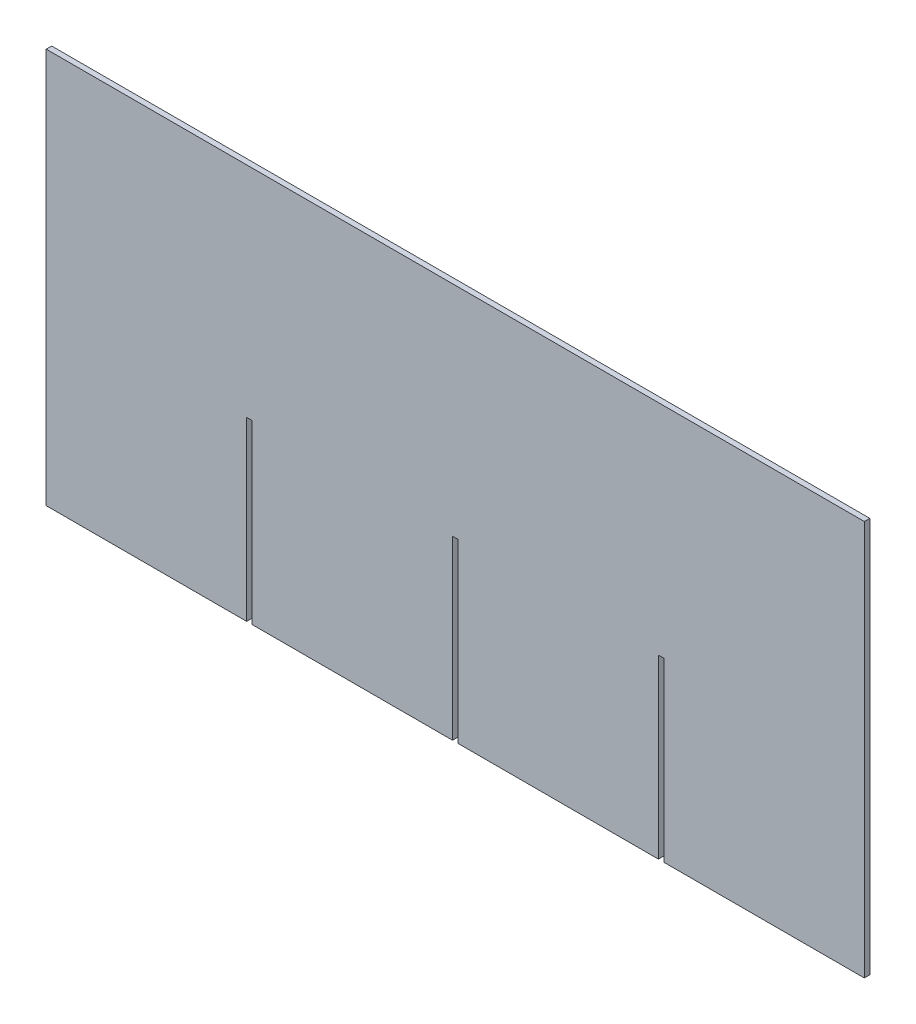
ISO-10303-21;
HEADER;
FILE_DESCRIPTION(('STEP AP214'),'2;1');
FILE_NAME('part.step','',(''),(''),'','','');
FILE_SCHEMA(('AUTOMOTIVE_DESIGN { 1 0 10303 214 1 1 1 1 }'));
ENDSEC;
DATA;
#1=APPLICATION_CONTEXT('core data for automotive mechanical design processes');
#2=APPLICATION_PROTOCOL_DEFINITION('international standard','automotive_design',2000,#1);
#3=PRODUCT_CONTEXT('',#1,'mechanical');
#4=PRODUCT('Part','Part','',(#3));
#5=PRODUCT_RELATED_PRODUCT_CATEGORY('part','',(#4));
#6=PRODUCT_DEFINITION_FORMATION('','',#4);
#7=PRODUCT_DEFINITION_CONTEXT('part definition',#1,'design');
#8=PRODUCT_DEFINITION('design','',#6,#7);
#9=PRODUCT_DEFINITION_SHAPE('','',#8);
#10=(LENGTH_UNIT() NAMED_UNIT(*) SI_UNIT(.MILLI.,.METRE.));
#11=(NAMED_UNIT(*) PLANE_ANGLE_UNIT() SI_UNIT($,.RADIAN.));
#12=(NAMED_UNIT(*) SI_UNIT($,.STERADIAN.) SOLID_ANGLE_UNIT());
#13=UNCERTAINTY_MEASURE_WITH_UNIT(LENGTH_MEASURE(1.E-05),#10,'distance_accuracy_value','');
#14=(GEOMETRIC_REPRESENTATION_CONTEXT(3) GLOBAL_UNCERTAINTY_ASSIGNED_CONTEXT((#13)) GLOBAL_UNIT_ASSIGNED_CONTEXT((#10,
#11,#12)) REPRESENTATION_CONTEXT('',''));
#15=CARTESIAN_POINT('',(0.,0.,0.));
#16=DIRECTION('',(0.,0.,1.));
#17=DIRECTION('',(1.,0.,0.));
#18=AXIS2_PLACEMENT_3D('',#15,#16,#17);
#19=CARTESIAN_POINT('',(-113.,-108.341463414634,3.));
#20=DIRECTION('',(1.,0.,0.));
#21=DIRECTION('',(0.,1.,0.));
#22=AXIS2_PLACEMENT_3D('',#19,#20,#21);
#23=PLANE('',#22);
#24=DIRECTION('',(0.,-1.,0.));
#25=VECTOR('',#24,1.);
#26=CARTESIAN_POINT('',(-113.,-108.341463414634,0.));
#27=LINE('',#26,#25);
#28=CARTESIAN_POINT('',(-113.,108.658536585366,0.));
#29=VERTEX_POINT('',#28);
#30=CARTESIAN_POINT('',(-113.,-108.341463414634,0.));
#31=VERTEX_POINT('',#30);
#32=EDGE_CURVE('E188',#29,#31,#27,.T.);
#33=ORIENTED_EDGE('',*,*,#32,.T.);
#34=DIRECTION('',(0.,0.,-1.));
#35=VECTOR('',#34,1.);
#36=CARTESIAN_POINT('',(-113.,-108.341463414634,3.));
#37=LINE('',#36,#35);
#38=CARTESIAN_POINT('',(-113.,-108.341463414634,3.));
#39=VERTEX_POINT('',#38);
#40=EDGE_CURVE('E11',#39,#31,#37,.T.);
#41=ORIENTED_EDGE('',*,*,#40,.F.);
#42=DIRECTION('',(0.,-1.,0.));
#43=VECTOR('',#42,1.);
#44=CARTESIAN_POINT('',(-113.,-108.341463414634,3.));
#45=LINE('',#44,#43);
#46=CARTESIAN_POINT('',(-113.,108.658536585366,3.));
#47=VERTEX_POINT('',#46);
#48=EDGE_CURVE('E234',#47,#39,#45,.T.);
#49=ORIENTED_EDGE('',*,*,#48,.F.);
#50=DIRECTION('',(0.,0.,-1.));
#51=VECTOR('',#50,1.);
#52=CARTESIAN_POINT('',(-113.,108.658536585366,3.));
#53=LINE('',#52,#51);
#54=EDGE_CURVE('E184',#47,#29,#53,.T.);
#55=ORIENTED_EDGE('',*,*,#54,.T.);
#56=EDGE_LOOP('',(#33,#41,#49,#55));
#57=FACE_BOUND('',#56,.T.);
#58=ADVANCED_FACE('F39',(#57),#23,.F.);
#59=CARTESIAN_POINT('',(-2.99999999999999,-108.341463414634,3.));
#60=DIRECTION('',(0.,1.,0.));
#61=DIRECTION('',(-1.,0.,0.));
#62=AXIS2_PLACEMENT_3D('',#59,#60,#61);
#63=PLANE('',#62);
#64=DIRECTION('',(1.,0.,0.));
#65=VECTOR('',#64,1.);
#66=CARTESIAN_POINT('',(-2.99999999999999,-108.341463414634,0.));
#67=LINE('',#66,#65);
#68=CARTESIAN_POINT('',(-2.99999999999999,-108.341463414634,0.));
#69=VERTEX_POINT('',#68);
#70=EDGE_CURVE('E192',#31,#69,#67,.T.);
#71=ORIENTED_EDGE('',*,*,#70,.T.);
#72=DIRECTION('',(0.,0.,-1.));
#73=VECTOR('',#72,1.);
#74=CARTESIAN_POINT('',(-2.99999999999999,-108.341463414634,3.));
#75=LINE('',#74,#73);
#76=CARTESIAN_POINT('',(-2.99999999999999,-108.341463414634,3.));
#77=VERTEX_POINT('',#76);
#78=EDGE_CURVE('E48',#77,#69,#75,.T.);
#79=ORIENTED_EDGE('',*,*,#78,.F.);
#80=DIRECTION('',(1.,0.,0.));
#81=VECTOR('',#80,1.);
#82=CARTESIAN_POINT('',(-2.99999999999999,-108.341463414634,3.));
#83=LINE('',#82,#81);
#84=EDGE_CURVE('E123',#39,#77,#83,.T.);
#85=ORIENTED_EDGE('',*,*,#84,.F.);
#86=ORIENTED_EDGE('',*,*,#40,.T.);
#87=EDGE_LOOP('',(#71,#79,#85,#86));
#88=FACE_BOUND('',#87,.T.);
#89=ADVANCED_FACE('F356',(#88),#63,.F.);
#90=CARTESIAN_POINT('',(-3.,-11.3414634146341,3.));
#91=DIRECTION('',(-1.,0.,0.));
#92=DIRECTION('',(0.,-1.,0.));
#93=AXIS2_PLACEMENT_3D('',#90,#91,#92);
#94=PLANE('',#93);
#95=DIRECTION('',(0.,1.,0.));
#96=VECTOR('',#95,1.);
#97=CARTESIAN_POINT('',(-3.,-11.3414634146341,0.));
#98=LINE('',#97,#96);
#99=CARTESIAN_POINT('',(-3.,-11.3414634146341,0.));
#100=VERTEX_POINT('',#99);
#101=EDGE_CURVE('E195',#69,#100,#98,.T.);
#102=ORIENTED_EDGE('',*,*,#101,.T.);
#103=DIRECTION('',(0.,0.,-1.));
#104=VECTOR('',#103,1.);
#105=CARTESIAN_POINT('',(-3.,-11.3414634146341,3.));
#106=LINE('',#105,#104);
#107=CARTESIAN_POINT('',(-3.,-11.3414634146341,3.));
#108=VERTEX_POINT('',#107);
#109=EDGE_CURVE('E277',#108,#100,#106,.T.);
#110=ORIENTED_EDGE('',*,*,#109,.F.);
#111=DIRECTION('',(0.,1.,0.));
#112=VECTOR('',#111,1.);
#113=CARTESIAN_POINT('',(-3.,-11.3414634146341,3.));
#114=LINE('',#113,#112);
#115=EDGE_CURVE('E287',#77,#108,#114,.T.);
#116=ORIENTED_EDGE('',*,*,#115,.F.);
#117=ORIENTED_EDGE('',*,*,#78,.T.);
#118=EDGE_LOOP('',(#102,#110,#116,#117));
#119=FACE_BOUND('',#118,.T.);
#120=ADVANCED_FACE('F285',(#119),#94,.F.);
#121=CARTESIAN_POINT('',(0.,-11.3414634146341,3.));
#122=DIRECTION('',(0.,1.,0.));
#123=DIRECTION('',(0.,0.,1.));
#124=AXIS2_PLACEMENT_3D('',#121,#122,#123);
#125=PLANE('',#124);
#126=DIRECTION('',(1.,0.,0.));
#127=VECTOR('',#126,1.);
#128=CARTESIAN_POINT('',(0.,-11.3414634146341,0.));
#129=LINE('',#128,#127);
#130=CARTESIAN_POINT('',(0.,-11.3414634146341,0.));
#131=VERTEX_POINT('',#130);
#132=EDGE_CURVE('E198',#100,#131,#129,.T.);
#133=ORIENTED_EDGE('',*,*,#132,.T.);
#134=DIRECTION('',(0.,0.,-1.));
#135=VECTOR('',#134,1.);
#136=CARTESIAN_POINT('',(0.,-11.3414634146341,3.));
#137=LINE('',#136,#135);
#138=CARTESIAN_POINT('',(0.,-11.3414634146341,3.));
#139=VERTEX_POINT('',#138);
#140=EDGE_CURVE('E273',#139,#131,#137,.T.);
#141=ORIENTED_EDGE('',*,*,#140,.F.);
#142=DIRECTION('',(1.,0.,0.));
#143=VECTOR('',#142,1.);
#144=CARTESIAN_POINT('',(0.,-11.3414634146341,3.));
#145=LINE('',#144,#143);
#146=EDGE_CURVE('E306',#108,#139,#145,.T.);
#147=ORIENTED_EDGE('',*,*,#146,.F.);
#148=ORIENTED_EDGE('',*,*,#109,.T.);
#149=EDGE_LOOP('',(#133,#141,#147,#148));
#150=FACE_BOUND('',#149,.T.);
#151=ADVANCED_FACE('F296',(#150),#125,.F.);
#152=CARTESIAN_POINT('',(0.,-108.341463414634,3.));
#153=DIRECTION('',(1.,0.,0.));
#154=DIRECTION('',(0.,0.,-1.));
#155=AXIS2_PLACEMENT_3D('',#152,#153,#154);
#156=PLANE('',#155);
#157=DIRECTION('',(0.,-1.,0.));
#158=VECTOR('',#157,1.);
#159=CARTESIAN_POINT('',(0.,-108.341463414634,0.));
#160=LINE('',#159,#158);
#161=CARTESIAN_POINT('',(0.,-108.341463414634,0.));
#162=VERTEX_POINT('',#161);
#163=EDGE_CURVE('E201',#131,#162,#160,.T.);
#164=ORIENTED_EDGE('',*,*,#163,.T.);
#165=DIRECTION('',(0.,0.,-1.));
#166=VECTOR('',#165,1.);
#167=CARTESIAN_POINT('',(0.,-108.341463414634,3.));
#168=LINE('',#167,#166);
#169=CARTESIAN_POINT('',(0.,-108.341463414634,3.));
#170=VERTEX_POINT('',#169);
#171=EDGE_CURVE('E269',#170,#162,#168,.T.);
#172=ORIENTED_EDGE('',*,*,#171,.F.);
#173=DIRECTION('',(0.,-1.,0.));
#174=VECTOR('',#173,1.);
#175=CARTESIAN_POINT('',(0.,-108.341463414634,3.));
#176=LINE('',#175,#174);
#177=EDGE_CURVE('E302',#139,#170,#176,.T.);
#178=ORIENTED_EDGE('',*,*,#177,.F.);
#179=ORIENTED_EDGE('',*,*,#140,.T.);
#180=EDGE_LOOP('',(#164,#172,#178,#179));
#181=FACE_BOUND('',#180,.T.);
#182=ADVANCED_FACE('F300',(#181),#156,.F.);
#183=CARTESIAN_POINT('',(110.,-108.341463414634,3.));
#184=DIRECTION('',(0.,1.,0.));
#185=DIRECTION('',(-1.,0.,0.));
#186=AXIS2_PLACEMENT_3D('',#183,#184,#185);
#187=PLANE('',#186);
#188=DIRECTION('',(1.,0.,0.));
#189=VECTOR('',#188,1.);
#190=CARTESIAN_POINT('',(110.,-108.341463414634,0.));
#191=LINE('',#190,#189);
#192=CARTESIAN_POINT('',(110.,-108.341463414634,0.));
#193=VERTEX_POINT('',#192);
#194=EDGE_CURVE('E204',#162,#193,#191,.T.);
#195=ORIENTED_EDGE('',*,*,#194,.T.);
#196=DIRECTION('',(0.,0.,-1.));
#197=VECTOR('',#196,1.);
#198=CARTESIAN_POINT('',(110.,-108.341463414634,3.));
#199=LINE('',#198,#197);
#200=CARTESIAN_POINT('',(110.,-108.341463414634,3.));
#201=VERTEX_POINT('',#200);
#202=EDGE_CURVE('E265',#201,#193,#199,.T.);
#203=ORIENTED_EDGE('',*,*,#202,.F.);
#204=DIRECTION('',(1.,0.,0.));
#205=VECTOR('',#204,1.);
#206=CARTESIAN_POINT('',(110.,-108.341463414634,3.));
#207=LINE('',#206,#205);
#208=EDGE_CURVE('E305',#170,#201,#207,.T.);
#209=ORIENTED_EDGE('',*,*,#208,.F.);
#210=ORIENTED_EDGE('',*,*,#171,.T.);
#211=EDGE_LOOP('',(#195,#203,#209,#210));
#212=FACE_BOUND('',#211,.T.);
#213=ADVANCED_FACE('F369',(#212),#187,.F.);
#214=CARTESIAN_POINT('',(110.,-11.3414634146341,3.));
#215=DIRECTION('',(-1.,0.,0.));
#216=DIRECTION('',(0.,-1.,0.));
#217=AXIS2_PLACEMENT_3D('',#214,#215,#216);
#218=PLANE('',#217);
#219=DIRECTION('',(0.,1.,0.));
#220=VECTOR('',#219,1.);
#221=CARTESIAN_POINT('',(110.,-11.3414634146341,0.));
#222=LINE('',#221,#220);
#223=CARTESIAN_POINT('',(110.,-11.3414634146341,0.));
#224=VERTEX_POINT('',#223);
#225=EDGE_CURVE('E207',#193,#224,#222,.T.);
#226=ORIENTED_EDGE('',*,*,#225,.T.);
#227=DIRECTION('',(0.,0.,-1.));
#228=VECTOR('',#227,1.);
#229=CARTESIAN_POINT('',(110.,-11.3414634146341,3.));
#230=LINE('',#229,#228);
#231=CARTESIAN_POINT('',(110.,-11.3414634146341,3.));
#232=VERTEX_POINT('',#231);
#233=EDGE_CURVE('E261',#232,#224,#230,.T.);
#234=ORIENTED_EDGE('',*,*,#233,.F.);
#235=DIRECTION('',(0.,1.,0.));
#236=VECTOR('',#235,1.);
#237=CARTESIAN_POINT('',(110.,-11.3414634146341,3.));
#238=LINE('',#237,#236);
#239=EDGE_CURVE('E310',#201,#232,#238,.T.);
#240=ORIENTED_EDGE('',*,*,#239,.F.);
#241=ORIENTED_EDGE('',*,*,#202,.T.);
#242=EDGE_LOOP('',(#226,#234,#240,#241));
#243=FACE_BOUND('',#242,.T.);
#244=ADVANCED_FACE('F372',(#243),#218,.F.);
#245=CARTESIAN_POINT('',(113.,-11.3414634146341,3.));
#246=DIRECTION('',(0.,1.,0.));
#247=DIRECTION('',(0.,0.,1.));
#248=AXIS2_PLACEMENT_3D('',#245,#246,#247);
#249=PLANE('',#248);
#250=DIRECTION('',(1.,0.,0.));
#251=VECTOR('',#250,1.);
#252=CARTESIAN_POINT('',(113.,-11.3414634146341,0.));
#253=LINE('',#252,#251);
#254=CARTESIAN_POINT('',(113.,-11.3414634146341,0.));
#255=VERTEX_POINT('',#254);
#256=EDGE_CURVE('E210',#224,#255,#253,.T.);
#257=ORIENTED_EDGE('',*,*,#256,.T.);
#258=DIRECTION('',(0.,0.,-1.));
#259=VECTOR('',#258,1.);
#260=CARTESIAN_POINT('',(113.,-11.3414634146341,3.));
#261=LINE('',#260,#259);
#262=CARTESIAN_POINT('',(113.,-11.3414634146341,3.));
#263=VERTEX_POINT('',#262);
#264=EDGE_CURVE('E257',#263,#255,#261,.T.);
#265=ORIENTED_EDGE('',*,*,#264,.F.);
#266=DIRECTION('',(1.,0.,0.));
#267=VECTOR('',#266,1.);
#268=CARTESIAN_POINT('',(113.,-11.3414634146341,3.));
#269=LINE('',#268,#267);
#270=EDGE_CURVE('E317',#232,#263,#269,.T.);
#271=ORIENTED_EDGE('',*,*,#270,.F.);
#272=ORIENTED_EDGE('',*,*,#233,.T.);
#273=EDGE_LOOP('',(#257,#265,#271,#272));
#274=FACE_BOUND('',#273,.T.);
#275=ADVANCED_FACE('F376',(#274),#249,.F.);
#276=CARTESIAN_POINT('',(113.,-108.341463414634,3.));
#277=DIRECTION('',(1.,0.,0.));
#278=DIRECTION('',(0.,0.,-1.));
#279=AXIS2_PLACEMENT_3D('',#276,#277,#278);
#280=PLANE('',#279);
#281=DIRECTION('',(0.,-1.,0.));
#282=VECTOR('',#281,1.);
#283=CARTESIAN_POINT('',(113.,-108.341463414634,0.));
#284=LINE('',#283,#282);
#285=CARTESIAN_POINT('',(113.,-108.341463414634,0.));
#286=VERTEX_POINT('',#285);
#287=EDGE_CURVE('E213',#255,#286,#284,.T.);
#288=ORIENTED_EDGE('',*,*,#287,.T.);
#289=DIRECTION('',(0.,0.,-1.));
#290=VECTOR('',#289,1.);
#291=CARTESIAN_POINT('',(113.,-108.341463414634,3.));
#292=LINE('',#291,#290);
#293=CARTESIAN_POINT('',(113.,-108.341463414634,3.));
#294=VERTEX_POINT('',#293);
#295=EDGE_CURVE('E253',#294,#286,#292,.T.);
#296=ORIENTED_EDGE('',*,*,#295,.F.);
#297=DIRECTION('',(0.,-1.,0.));
#298=VECTOR('',#297,1.);
#299=CARTESIAN_POINT('',(113.,-108.341463414634,3.));
#300=LINE('',#299,#298);
#301=EDGE_CURVE('E320',#263,#294,#300,.T.);
#302=ORIENTED_EDGE('',*,*,#301,.F.);
#303=ORIENTED_EDGE('',*,*,#264,.T.);
#304=EDGE_LOOP('',(#288,#296,#302,#303));
#305=FACE_BOUND('',#304,.T.);
#306=ADVANCED_FACE('F380',(#305),#280,.F.);
#307=CARTESIAN_POINT('',(223.,-108.341463414634,3.));
#308=DIRECTION('',(0.,1.,0.));
#309=DIRECTION('',(-1.,0.,0.));
#310=AXIS2_PLACEMENT_3D('',#307,#308,#309);
#311=PLANE('',#310);
#312=DIRECTION('',(1.,0.,0.));
#313=VECTOR('',#312,1.);
#314=CARTESIAN_POINT('',(223.,-108.341463414634,0.));
#315=LINE('',#314,#313);
#316=CARTESIAN_POINT('',(223.,-108.341463414634,0.));
#317=VERTEX_POINT('',#316);
#318=EDGE_CURVE('E216',#286,#317,#315,.T.);
#319=ORIENTED_EDGE('',*,*,#318,.T.);
#320=DIRECTION('',(0.,0.,-1.));
#321=VECTOR('',#320,1.);
#322=CARTESIAN_POINT('',(223.,-108.341463414634,3.));
#323=LINE('',#322,#321);
#324=CARTESIAN_POINT('',(223.,-108.341463414634,3.));
#325=VERTEX_POINT('',#324);
#326=EDGE_CURVE('E249',#325,#317,#323,.T.);
#327=ORIENTED_EDGE('',*,*,#326,.F.);
#328=DIRECTION('',(1.,0.,0.));
#329=VECTOR('',#328,1.);
#330=CARTESIAN_POINT('',(223.,-108.341463414634,3.));
#331=LINE('',#330,#329);
#332=EDGE_CURVE('E323',#294,#325,#331,.T.);
#333=ORIENTED_EDGE('',*,*,#332,.F.);
#334=ORIENTED_EDGE('',*,*,#295,.T.);
#335=EDGE_LOOP('',(#319,#327,#333,#334));
#336=FACE_BOUND('',#335,.T.);
#337=ADVANCED_FACE('F384',(#336),#311,.F.);
#338=CARTESIAN_POINT('',(223.,-11.3414634146341,3.));
#339=DIRECTION('',(-1.,0.,0.));
#340=DIRECTION('',(0.,0.,1.));
#341=AXIS2_PLACEMENT_3D('',#338,#339,#340);
#342=PLANE('',#341);
#343=DIRECTION('',(0.,1.,0.));
#344=VECTOR('',#343,1.);
#345=CARTESIAN_POINT('',(223.,-11.3414634146341,0.));
#346=LINE('',#345,#344);
#347=CARTESIAN_POINT('',(223.,-11.3414634146341,0.));
#348=VERTEX_POINT('',#347);
#349=EDGE_CURVE('E219',#317,#348,#346,.T.);
#350=ORIENTED_EDGE('',*,*,#349,.T.);
#351=DIRECTION('',(0.,0.,-1.));
#352=VECTOR('',#351,1.);
#353=CARTESIAN_POINT('',(223.,-11.3414634146341,3.));
#354=LINE('',#353,#352);
#355=CARTESIAN_POINT('',(223.,-11.3414634146341,3.));
#356=VERTEX_POINT('',#355);
#357=EDGE_CURVE('E245',#356,#348,#354,.T.);
#358=ORIENTED_EDGE('',*,*,#357,.F.);
#359=DIRECTION('',(0.,1.,0.));
#360=VECTOR('',#359,1.);
#361=CARTESIAN_POINT('',(223.,-11.3414634146341,3.));
#362=LINE('',#361,#360);
#363=EDGE_CURVE('E326',#325,#356,#362,.T.);
#364=ORIENTED_EDGE('',*,*,#363,.F.);
#365=ORIENTED_EDGE('',*,*,#326,.T.);
#366=EDGE_LOOP('',(#350,#358,#364,#365));
#367=FACE_BOUND('',#366,.T.);
#368=ADVANCED_FACE('F388',(#367),#342,.F.);
#369=CARTESIAN_POINT('',(226.,-11.3414634146341,3.));
#370=DIRECTION('',(0.,1.,0.));
#371=DIRECTION('',(-1.,0.,0.));
#372=AXIS2_PLACEMENT_3D('',#369,#370,#371);
#373=PLANE('',#372);
#374=DIRECTION('',(1.,0.,0.));
#375=VECTOR('',#374,1.);
#376=CARTESIAN_POINT('',(226.,-11.3414634146341,0.));
#377=LINE('',#376,#375);
#378=CARTESIAN_POINT('',(226.,-11.3414634146341,0.));
#379=VERTEX_POINT('',#378);
#380=EDGE_CURVE('E222',#348,#379,#377,.T.);
#381=ORIENTED_EDGE('',*,*,#380,.T.);
#382=DIRECTION('',(0.,0.,-1.));
#383=VECTOR('',#382,1.);
#384=CARTESIAN_POINT('',(226.,-11.3414634146341,3.));
#385=LINE('',#384,#383);
#386=CARTESIAN_POINT('',(226.,-11.3414634146341,3.));
#387=VERTEX_POINT('',#386);
#388=EDGE_CURVE('E241',#387,#379,#385,.T.);
#389=ORIENTED_EDGE('',*,*,#388,.F.);
#390=DIRECTION('',(1.,0.,0.));
#391=VECTOR('',#390,1.);
#392=CARTESIAN_POINT('',(226.,-11.3414634146341,3.));
#393=LINE('',#392,#391);
#394=EDGE_CURVE('E329',#356,#387,#393,.T.);
#395=ORIENTED_EDGE('',*,*,#394,.F.);
#396=ORIENTED_EDGE('',*,*,#357,.T.);
#397=EDGE_LOOP('',(#381,#389,#395,#396));
#398=FACE_BOUND('',#397,.T.);
#399=ADVANCED_FACE('F337',(#398),#373,.F.);
#400=CARTESIAN_POINT('',(226.,-108.341463414634,3.));
#401=DIRECTION('',(1.,0.,0.));
#402=DIRECTION('',(0.,0.,-1.));
#403=AXIS2_PLACEMENT_3D('',#400,#401,#402);
#404=PLANE('',#403);
#405=DIRECTION('',(0.,-1.,0.));
#406=VECTOR('',#405,1.);
#407=CARTESIAN_POINT('',(226.,-108.341463414634,0.));
#408=LINE('',#407,#406);
#409=CARTESIAN_POINT('',(226.,-108.341463414634,0.));
#410=VERTEX_POINT('',#409);
#411=EDGE_CURVE('E225',#379,#410,#408,.T.);
#412=ORIENTED_EDGE('',*,*,#411,.T.);
#413=DIRECTION('',(0.,0.,-1.));
#414=VECTOR('',#413,1.);
#415=CARTESIAN_POINT('',(226.,-108.341463414634,3.));
#416=LINE('',#415,#414);
#417=CARTESIAN_POINT('',(226.,-108.341463414634,3.));
#418=VERTEX_POINT('',#417);
#419=EDGE_CURVE('E177',#418,#410,#416,.T.);
#420=ORIENTED_EDGE('',*,*,#419,.F.);
#421=DIRECTION('',(0.,-1.,0.));
#422=VECTOR('',#421,1.);
#423=CARTESIAN_POINT('',(226.,-108.341463414634,3.));
#424=LINE('',#423,#422);
#425=EDGE_CURVE('E166',#387,#418,#424,.T.);
#426=ORIENTED_EDGE('',*,*,#425,.F.);
#427=ORIENTED_EDGE('',*,*,#388,.T.);
#428=EDGE_LOOP('',(#412,#420,#426,#427));
#429=FACE_BOUND('',#428,.T.);
#430=ADVANCED_FACE('F341',(#429),#404,.F.);
#431=CARTESIAN_POINT('',(336.,-108.341463414634,3.));
#432=DIRECTION('',(0.,1.,0.));
#433=DIRECTION('',(0.,0.,1.));
#434=AXIS2_PLACEMENT_3D('',#431,#432,#433);
#435=PLANE('',#434);
#436=DIRECTION('',(1.,0.,0.));
#437=VECTOR('',#436,1.);
#438=CARTESIAN_POINT('',(336.,-108.341463414634,0.));
#439=LINE('',#438,#437);
#440=CARTESIAN_POINT('',(336.,-108.341463414634,0.));
#441=VERTEX_POINT('',#440);
#442=EDGE_CURVE('E175',#410,#441,#439,.T.);
#443=ORIENTED_EDGE('',*,*,#442,.T.);
#444=DIRECTION('',(0.,0.,-1.));
#445=VECTOR('',#444,1.);
#446=CARTESIAN_POINT('',(336.,-108.341463414634,3.));
#447=LINE('',#446,#445);
#448=CARTESIAN_POINT('',(336.,-108.341463414634,3.));
#449=VERTEX_POINT('',#448);
#450=EDGE_CURVE('E172',#449,#441,#447,.T.);
#451=ORIENTED_EDGE('',*,*,#450,.F.);
#452=DIRECTION('',(1.,0.,0.));
#453=VECTOR('',#452,1.);
#454=CARTESIAN_POINT('',(336.,-108.341463414634,3.));
#455=LINE('',#454,#453);
#456=EDGE_CURVE('E160',#418,#449,#455,.T.);
#457=ORIENTED_EDGE('',*,*,#456,.F.);
#458=ORIENTED_EDGE('',*,*,#419,.T.);
#459=EDGE_LOOP('',(#443,#451,#457,#458));
#460=FACE_BOUND('',#459,.T.);
#461=ADVANCED_FACE('F173',(#460),#435,.F.);
#462=CARTESIAN_POINT('',(336.,108.658536585366,3.));
#463=DIRECTION('',(-1.,0.,0.));
#464=DIRECTION('',(0.,0.,1.));
#465=AXIS2_PLACEMENT_3D('',#462,#463,#464);
#466=PLANE('',#465);
#467=DIRECTION('',(0.,1.,0.));
#468=VECTOR('',#467,1.);
#469=CARTESIAN_POINT('',(336.,108.658536585366,0.));
#470=LINE('',#469,#468);
#471=CARTESIAN_POINT('',(336.,108.658536585366,0.));
#472=VERTEX_POINT('',#471);
#473=EDGE_CURVE('E109',#441,#472,#470,.T.);
#474=ORIENTED_EDGE('',*,*,#473,.T.);
#475=DIRECTION('',(0.,0.,-1.));
#476=VECTOR('',#475,1.);
#477=CARTESIAN_POINT('',(336.,108.658536585366,3.));
#478=LINE('',#477,#476);
#479=CARTESIAN_POINT('',(336.,108.658536585366,3.));
#480=VERTEX_POINT('',#479);
#481=EDGE_CURVE('E178',#480,#472,#478,.T.);
#482=ORIENTED_EDGE('',*,*,#481,.F.);
#483=DIRECTION('',(0.,1.,0.));
#484=VECTOR('',#483,1.);
#485=CARTESIAN_POINT('',(336.,108.658536585366,3.));
#486=LINE('',#485,#484);
#487=EDGE_CURVE('E164',#449,#480,#486,.T.);
#488=ORIENTED_EDGE('',*,*,#487,.F.);
#489=ORIENTED_EDGE('',*,*,#450,.T.);
#490=EDGE_LOOP('',(#474,#482,#488,#489));
#491=FACE_BOUND('',#490,.T.);
#492=ADVANCED_FACE('F180',(#491),#466,.F.);
#493=CARTESIAN_POINT('',(-113.,108.658536585366,3.));
#494=DIRECTION('',(0.,-1.,0.));
#495=DIRECTION('',(1.,0.,0.));
#496=AXIS2_PLACEMENT_3D('',#493,#494,#495);
#497=PLANE('',#496);
#498=DIRECTION('',(-1.,0.,0.));
#499=VECTOR('',#498,1.);
#500=CARTESIAN_POINT('',(-113.,108.658536585366,0.));
#501=LINE('',#500,#499);
#502=EDGE_CURVE('E115',#472,#29,#501,.T.);
#503=ORIENTED_EDGE('',*,*,#502,.T.);
#504=ORIENTED_EDGE('',*,*,#54,.F.);
#505=DIRECTION('',(-1.,0.,0.));
#506=VECTOR('',#505,1.);
#507=CARTESIAN_POINT('',(-113.,108.658536585366,3.));
#508=LINE('',#507,#506);
#509=EDGE_CURVE('E56',#480,#47,#508,.T.);
#510=ORIENTED_EDGE('',*,*,#509,.F.);
#511=ORIENTED_EDGE('',*,*,#481,.T.);
#512=EDGE_LOOP('',(#503,#504,#510,#511));
#513=FACE_BOUND('',#512,.T.);
#514=ADVANCED_FACE('F345',(#513),#497,.F.);
#515=CARTESIAN_POINT('',(0.,0.,3.));
#516=DIRECTION('',(0.,0.,-1.));
#517=DIRECTION('',(-1.,0.,0.));
#518=AXIS2_PLACEMENT_3D('',#515,#516,#517);
#519=PLANE('',#518);
#520=ORIENTED_EDGE('',*,*,#48,.T.);
#521=ORIENTED_EDGE('',*,*,#84,.T.);
#522=ORIENTED_EDGE('',*,*,#115,.T.);
#523=ORIENTED_EDGE('',*,*,#146,.T.);
#524=ORIENTED_EDGE('',*,*,#177,.T.);
#525=ORIENTED_EDGE('',*,*,#208,.T.);
#526=ORIENTED_EDGE('',*,*,#239,.T.);
#527=ORIENTED_EDGE('',*,*,#270,.T.);
#528=ORIENTED_EDGE('',*,*,#301,.T.);
#529=ORIENTED_EDGE('',*,*,#332,.T.);
#530=ORIENTED_EDGE('',*,*,#363,.T.);
#531=ORIENTED_EDGE('',*,*,#394,.T.);
#532=ORIENTED_EDGE('',*,*,#425,.T.);
#533=ORIENTED_EDGE('',*,*,#456,.T.);
#534=ORIENTED_EDGE('',*,*,#487,.T.);
#535=ORIENTED_EDGE('',*,*,#509,.T.);
#536=EDGE_LOOP('',(#520,#521,#522,#523,#524,#525,#526,#527,#528,#529,#530,#531,#532,#533,#534,#535));
#537=FACE_BOUND('',#536,.T.);
#538=ADVANCED_FACE('F162',(#537),#519,.F.);
#539=CARTESIAN_POINT('',(0.,0.,0.));
#540=DIRECTION('',(0.,0.,-1.));
#541=DIRECTION('',(-1.,0.,0.));
#542=AXIS2_PLACEMENT_3D('',#539,#540,#541);
#543=PLANE('',#542);
#544=ORIENTED_EDGE('',*,*,#32,.F.);
#545=ORIENTED_EDGE('',*,*,#502,.F.);
#546=ORIENTED_EDGE('',*,*,#473,.F.);
#547=ORIENTED_EDGE('',*,*,#442,.F.);
#548=ORIENTED_EDGE('',*,*,#411,.F.);
#549=ORIENTED_EDGE('',*,*,#380,.F.);
#550=ORIENTED_EDGE('',*,*,#349,.F.);
#551=ORIENTED_EDGE('',*,*,#318,.F.);
#552=ORIENTED_EDGE('',*,*,#287,.F.);
#553=ORIENTED_EDGE('',*,*,#256,.F.);
#554=ORIENTED_EDGE('',*,*,#225,.F.);
#555=ORIENTED_EDGE('',*,*,#194,.F.);
#556=ORIENTED_EDGE('',*,*,#163,.F.);
#557=ORIENTED_EDGE('',*,*,#132,.F.);
#558=ORIENTED_EDGE('',*,*,#101,.F.);
#559=ORIENTED_EDGE('',*,*,#70,.F.);
#560=EDGE_LOOP('',(#544,#545,#546,#547,#548,#549,#550,#551,#552,#553,#554,#555,#556,#557,#558,#559));
#561=FACE_BOUND('',#560,.T.);
#562=ADVANCED_FACE('F291',(#561),#543,.T.);
#563=CLOSED_SHELL('',(#58,#89,#120,#151,#182,#213,#244,#275,#306,#337,#368,#399,#430,#461,#492,
#514,#538,#562));
#564=MANIFOLD_SOLID_BREP('B2',#563);
#565=ADVANCED_BREP_SHAPE_REPRESENTATION('',(#18,#564),#14);
#566=SHAPE_DEFINITION_REPRESENTATION(#9,#565);
ENDSEC;
END-ISO-10303-21;
